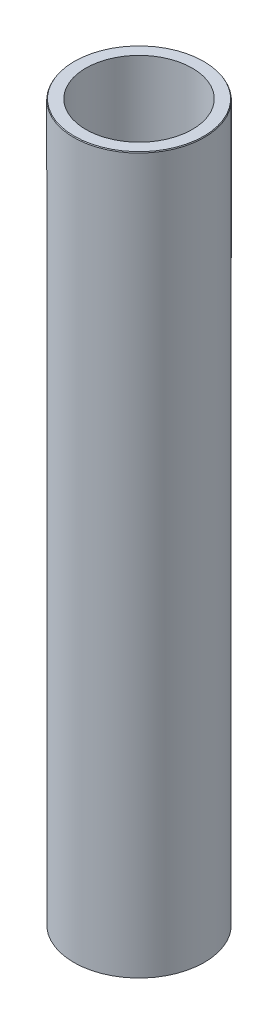
ISO-10303-21;
HEADER;
FILE_DESCRIPTION(('STEP AP214'),'2;1');
FILE_NAME('part.step','',(''),(''),'','','');
FILE_SCHEMA(('AUTOMOTIVE_DESIGN { 1 0 10303 214 1 1 1 1 }'));
ENDSEC;
DATA;
#1=APPLICATION_CONTEXT('core data for automotive mechanical design processes');
#2=APPLICATION_PROTOCOL_DEFINITION('international standard','automotive_design',2000,#1);
#3=PRODUCT_CONTEXT('',#1,'mechanical');
#4=PRODUCT('Part','Part','',(#3));
#5=PRODUCT_RELATED_PRODUCT_CATEGORY('part','',(#4));
#6=PRODUCT_DEFINITION_FORMATION('','',#4);
#7=PRODUCT_DEFINITION_CONTEXT('part definition',#1,'design');
#8=PRODUCT_DEFINITION('design','',#6,#7);
#9=PRODUCT_DEFINITION_SHAPE('','',#8);
#10=(LENGTH_UNIT() NAMED_UNIT(*) SI_UNIT(.MILLI.,.METRE.));
#11=(NAMED_UNIT(*) PLANE_ANGLE_UNIT() SI_UNIT($,.RADIAN.));
#12=(NAMED_UNIT(*) SI_UNIT($,.STERADIAN.) SOLID_ANGLE_UNIT());
#13=UNCERTAINTY_MEASURE_WITH_UNIT(LENGTH_MEASURE(1.E-05),#10,'distance_accuracy_value','');
#14=(GEOMETRIC_REPRESENTATION_CONTEXT(3) GLOBAL_UNCERTAINTY_ASSIGNED_CONTEXT((#13)) GLOBAL_UNIT_ASSIGNED_CONTEXT((#10,
#11,#12)) REPRESENTATION_CONTEXT('',''));
#15=CARTESIAN_POINT('',(0.,0.,0.));
#16=DIRECTION('',(0.,0.,1.));
#17=DIRECTION('',(1.,0.,0.));
#18=AXIS2_PLACEMENT_3D('',#15,#16,#17);
#19=CARTESIAN_POINT('',(0.,466.05665549588,0.));
#20=DIRECTION('',(0.,-1.,0.));
#21=DIRECTION('',(0.,0.,-1.));
#22=AXIS2_PLACEMENT_3D('',#19,#20,#21);
#23=CYLINDRICAL_SURFACE('',#22,42.5);
#24=CARTESIAN_POINT('',(0.,465.484988848938,0.));
#25=DIRECTION('',(0.,1.,0.));
#26=DIRECTION('',(0.,0.,1.));
#27=AXIS2_PLACEMENT_3D('',#24,#25,#26);
#28=CIRCLE('',#27,42.5);
#29=CARTESIAN_POINT('',(0.,465.484988848938,-42.5));
#30=VERTEX_POINT('',#29);
#31=EDGE_CURVE('E50',#30,#30,#28,.F.);
#32=CARTESIAN_POINT('',(0.,0.330051892498795,0.));
#33=DIRECTION('',(0.,1.,0.));
#34=DIRECTION('',(0.,0.,1.));
#35=AXIS2_PLACEMENT_3D('',#32,#33,#34);
#36=CIRCLE('',#35,42.5);
#37=CARTESIAN_POINT('',(0.,0.330051892498739,-42.5));
#38=VERTEX_POINT('',#37);
#39=EDGE_CURVE('E51',#38,#38,#36,.T.);
#40=CARTESIAN_POINT('',(0.,465.484988848938,-42.5));
#41=CARTESIAN_POINT('',(0.,460.639624922308,-42.5));
#42=CARTESIAN_POINT('',(0.,455.794260995678,-42.5));
#43=CARTESIAN_POINT('',(0.,446.103533142419,-42.5));
#44=CARTESIAN_POINT('',(0.,441.25816921579,-42.5));
#45=CARTESIAN_POINT('',(0.,431.567441362531,-42.5));
#46=CARTESIAN_POINT('',(0.,426.722077435901,-42.5));
#47=CARTESIAN_POINT('',(0.,417.031349582642,-42.5));
#48=CARTESIAN_POINT('',(0.,412.185985656012,-42.5));
#49=CARTESIAN_POINT('',(0.,402.495257802753,-42.5));
#50=CARTESIAN_POINT('',(0.,397.649893876124,-42.5));
#51=CARTESIAN_POINT('',(0.,387.959166022864,-42.5));
#52=CARTESIAN_POINT('',(0.,383.113802096235,-42.5));
#53=CARTESIAN_POINT('',(0.,373.423074242976,-42.5));
#54=CARTESIAN_POINT('',(0.,368.577710316346,-42.5));
#55=CARTESIAN_POINT('',(0.,358.886982463087,-42.5));
#56=CARTESIAN_POINT('',(0.,354.041618536458,-42.5));
#57=CARTESIAN_POINT('',(0.,344.350890683198,-42.5));
#58=CARTESIAN_POINT('',(0.,339.505526756569,-42.5));
#59=CARTESIAN_POINT('',(0.,329.81479890331,-42.5));
#60=CARTESIAN_POINT('',(0.,324.96943497668,-42.5));
#61=CARTESIAN_POINT('',(0.,315.278707123421,-42.5));
#62=CARTESIAN_POINT('',(0.,310.433343196791,-42.5));
#63=CARTESIAN_POINT('',(0.,300.742615343532,-42.5));
#64=CARTESIAN_POINT('',(0.,295.897251416903,-42.5));
#65=CARTESIAN_POINT('',(0.,286.206523563643,-42.5));
#66=CARTESIAN_POINT('',(0.,281.361159637014,-42.5));
#67=CARTESIAN_POINT('',(0.,271.670431783755,-42.5));
#68=CARTESIAN_POINT('',(0.,266.825067857125,-42.5));
#69=CARTESIAN_POINT('',(0.,257.134340003866,-42.5));
#70=CARTESIAN_POINT('',(0.,252.288976077236,-42.5));
#71=CARTESIAN_POINT('',(0.,242.598248223977,-42.5));
#72=CARTESIAN_POINT('',(0.,237.752884297348,-42.5));
#73=CARTESIAN_POINT('',(0.,228.062156444089,-42.5));
#74=CARTESIAN_POINT('',(0.,223.216792517459,-42.5));
#75=CARTESIAN_POINT('',(0.,213.5260646642,-42.5));
#76=CARTESIAN_POINT('',(0.,208.68070073757,-42.5));
#77=CARTESIAN_POINT('',(0.,198.989972884311,-42.5));
#78=CARTESIAN_POINT('',(0.,194.144608957682,-42.5));
#79=CARTESIAN_POINT('',(0.,184.453881104422,-42.5));
#80=CARTESIAN_POINT('',(0.,179.608517177793,-42.5));
#81=CARTESIAN_POINT('',(0.,169.917789324534,-42.5));
#82=CARTESIAN_POINT('',(0.,165.072425397904,-42.5));
#83=CARTESIAN_POINT('',(0.,155.381697544645,-42.5));
#84=CARTESIAN_POINT('',(0.,150.536333618015,-42.5));
#85=CARTESIAN_POINT('',(0.,140.845605764756,-42.5));
#86=CARTESIAN_POINT('',(0.,136.000241838127,-42.5));
#87=CARTESIAN_POINT('',(0.,126.309513984868,-42.5));
#88=CARTESIAN_POINT('',(0.,121.464150058238,-42.5));
#89=CARTESIAN_POINT('',(0.,111.773422204979,-42.5));
#90=CARTESIAN_POINT('',(0.,106.928058278349,-42.5));
#91=CARTESIAN_POINT('',(0.,97.2373304250902,-42.5));
#92=CARTESIAN_POINT('',(0.,92.3919664984606,-42.5));
#93=CARTESIAN_POINT('',(0.,82.7012386452015,-42.5));
#94=CARTESIAN_POINT('',(0.,77.8558747185719,-42.5));
#95=CARTESIAN_POINT('',(0.,68.1651468653127,-42.5));
#96=CARTESIAN_POINT('',(0.,63.3197829386832,-42.5));
#97=CARTESIAN_POINT('',(0.,53.629055085424,-42.5));
#98=CARTESIAN_POINT('',(0.,48.7836911587945,-42.5));
#99=CARTESIAN_POINT('',(0.,39.0929633055353,-42.5));
#100=CARTESIAN_POINT('',(0.,34.2475993789057,-42.5));
#101=CARTESIAN_POINT('',(0.,24.5568715256466,-42.5));
#102=CARTESIAN_POINT('',(0.,19.711507599017,-42.5));
#103=CARTESIAN_POINT('',(0.,10.0207797457579,-42.5));
#104=CARTESIAN_POINT('',(0.,5.17541581912832,-42.5));
#105=CARTESIAN_POINT('',(0.,0.330051892498739,-42.5));
#106=B_SPLINE_CURVE_WITH_KNOTS('',3,(#40,#41,#42,#43,#44,#45,#46,#47,#48,#49,#50,#51,#52,#53,
#54,#55,#56,#57,#58,#59,#60,#61,#62,#63,#64,#65,#66,#67,#68,#69,#70,#71,#72,#73,#74,#75,#76,#77,
#78,#79,#80,#81,#82,#83,#84,#85,#86,#87,#88,#89,#90,#91,#92,#93,#94,#95,#96,#97,#98,#99,#100,
#101,#102,#103,#104,#105),.UNSPECIFIED.,.F.,.F.,(4,2,2,2,2,2,2,2,2,2,2,2,2,2,2,2,2,2,2,2,2,2,2,
2,2,2,2,2,2,2,2,2,4),(0.,14.5360917798887,29.0721835597774,43.6082753396661,58.1443671195548,
72.6804588994435,87.2165506793323,101.752642459221,116.28873423911,130.824826018998,
145.360917798887,159.897009578776,174.433101358665,188.969193138553,203.505284918442,
218.041376698331,232.577468478219,247.113560258108,261.649652037997,276.185743817886,
290.721835597774,305.257927377663,319.794019157552,334.33011093744,348.866202717329,
363.402294497218,377.938386277107,392.474478056995,407.010569836884,421.546661616773,
436.082753396661,450.61884517655,465.154936956439),.UNSPECIFIED.);
#107=EDGE_CURVE('BSEAM39',#30,#38,#106,.T.);
#108=ORIENTED_EDGE('',*,*,#31,.T.);
#109=ORIENTED_EDGE('',*,*,#39,.T.);
#110=ORIENTED_EDGE('',*,*,#107,.T.);
#111=ORIENTED_EDGE('',*,*,#107,.F.);
#112=EDGE_LOOP('',(#108,#110,#109,#111));
#113=FACE_BOUND('',#112,.T.);
#114=ADVANCED_FACE('F39',(#113),#23,.T.);
#115=CARTESIAN_POINT('',(0.,466.05665549588,0.));
#116=DIRECTION('',(0.,1.,0.));
#117=DIRECTION('',(0.,0.,1.));
#118=AXIS2_PLACEMENT_3D('',#115,#116,#117);
#119=PLANE('',#118);
#120=CARTESIAN_POINT('',(0.,466.05665549588,0.));
#121=DIRECTION('',(0.,1.,0.));
#122=DIRECTION('',(0.,0.,1.));
#123=AXIS2_PLACEMENT_3D('',#120,#121,#122);
#124=CIRCLE('',#123,42.1699481075014);
#125=CARTESIAN_POINT('',(0.,466.05665549588,42.1699481075014));
#126=VERTEX_POINT('',#125);
#127=EDGE_CURVE('E54',#126,#126,#124,.T.);
#128=ORIENTED_EDGE('',*,*,#127,.T.);
#129=EDGE_LOOP('',(#128));
#130=FACE_BOUND('',#129,.T.);
#131=CARTESIAN_POINT('',(0.,466.05665549588,0.));
#132=DIRECTION('',(0.,1.,0.));
#133=DIRECTION('',(0.,0.,1.));
#134=AXIS2_PLACEMENT_3D('',#131,#132,#133);
#135=CIRCLE('',#134,34.6484414434877);
#136=CARTESIAN_POINT('',(0.,466.05665549588,-34.6484414434877));
#137=VERTEX_POINT('',#136);
#138=EDGE_CURVE('E58',#137,#137,#135,.T.);
#139=ORIENTED_EDGE('',*,*,#138,.F.);
#140=EDGE_LOOP('',(#139));
#141=FACE_BOUND('',#140,.T.);
#142=ADVANCED_FACE('F69',(#130,#141),#119,.T.);
#143=CARTESIAN_POINT('',(0.,0.,0.));
#144=DIRECTION('',(0.,1.,0.));
#145=DIRECTION('',(0.,0.,1.));
#146=AXIS2_PLACEMENT_3D('',#143,#144,#145);
#147=PLANE('',#146);
#148=CARTESIAN_POINT('',(0.,0.,0.));
#149=DIRECTION('',(0.,1.,0.));
#150=DIRECTION('',(0.,0.,1.));
#151=AXIS2_PLACEMENT_3D('',#148,#149,#150);
#152=CIRCLE('',#151,41.9283333530578);
#153=CARTESIAN_POINT('',(0.,0.,41.9283333530578));
#154=VERTEX_POINT('',#153);
#155=EDGE_CURVE('E10',#154,#154,#152,.F.);
#156=ORIENTED_EDGE('',*,*,#155,.T.);
#157=EDGE_LOOP('',(#156));
#158=FACE_BOUND('',#157,.T.);
#159=CARTESIAN_POINT('',(0.,0.,0.));
#160=DIRECTION('',(0.,1.,0.));
#161=DIRECTION('',(0.,0.,1.));
#162=AXIS2_PLACEMENT_3D('',#159,#160,#161);
#163=CIRCLE('',#162,34.6484414434877);
#164=CARTESIAN_POINT('',(0.,0.,-34.6484414434877));
#165=VERTEX_POINT('',#164);
#166=EDGE_CURVE('E63',#165,#165,#163,.T.);
#167=ORIENTED_EDGE('',*,*,#166,.T.);
#168=EDGE_LOOP('',(#167));
#169=FACE_BOUND('',#168,.T.);
#170=ADVANCED_FACE('F75',(#158,#169),#147,.F.);
#171=CARTESIAN_POINT('',(0.,466.05665549588,0.));
#172=DIRECTION('',(0.,-1.,0.));
#173=DIRECTION('',(0.,0.,-1.));
#174=AXIS2_PLACEMENT_3D('',#171,#172,#173);
#175=CYLINDRICAL_SURFACE('',#174,34.6484414434877);
#176=CARTESIAN_POINT('',(0.,466.05665549588,-34.6484414434877));
#177=CARTESIAN_POINT('',(0.,461.201898667797,-34.6484414434877));
#178=CARTESIAN_POINT('',(0.,456.347141839715,-34.6484414434877));
#179=CARTESIAN_POINT('',(0.,446.637628183551,-34.6484414434877));
#180=CARTESIAN_POINT('',(0.,441.782871355469,-34.6484414434877));
#181=CARTESIAN_POINT('',(0.,432.073357699305,-34.6484414434877));
#182=CARTESIAN_POINT('',(0.,427.218600871223,-34.6484414434877));
#183=CARTESIAN_POINT('',(0.,417.509087215059,-34.6484414434877));
#184=CARTESIAN_POINT('',(0.,412.654330386977,-34.6484414434877));
#185=CARTESIAN_POINT('',(0.,402.944816730812,-34.6484414434877));
#186=CARTESIAN_POINT('',(0.,398.09005990273,-34.6484414434877));
#187=CARTESIAN_POINT('',(0.,388.380546246566,-34.6484414434877));
#188=CARTESIAN_POINT('',(0.,383.525789418484,-34.6484414434877));
#189=CARTESIAN_POINT('',(0.,373.81627576232,-34.6484414434877));
#190=CARTESIAN_POINT('',(0.,368.961518934238,-34.6484414434877));
#191=CARTESIAN_POINT('',(0.,359.252005278074,-34.6484414434877));
#192=CARTESIAN_POINT('',(0.,354.397248449992,-34.6484414434877));
#193=CARTESIAN_POINT('',(0.,344.687734793828,-34.6484414434877));
#194=CARTESIAN_POINT('',(0.,339.832977965745,-34.6484414434877));
#195=CARTESIAN_POINT('',(0.,330.123464309581,-34.6484414434877));
#196=CARTESIAN_POINT('',(0.,325.268707481499,-34.6484414434877));
#197=CARTESIAN_POINT('',(0.,315.559193825335,-34.6484414434877));
#198=CARTESIAN_POINT('',(0.,310.704436997253,-34.6484414434877));
#199=CARTESIAN_POINT('',(0.,300.994923341089,-34.6484414434877));
#200=CARTESIAN_POINT('',(0.,296.140166513007,-34.6484414434877));
#201=CARTESIAN_POINT('',(0.,286.430652856843,-34.6484414434877));
#202=CARTESIAN_POINT('',(0.,281.57589602876,-34.6484414434877));
#203=CARTESIAN_POINT('',(0.,271.866382372596,-34.6484414434877));
#204=CARTESIAN_POINT('',(0.,267.011625544514,-34.6484414434877));
#205=CARTESIAN_POINT('',(0.,257.30211188835,-34.6484414434877));
#206=CARTESIAN_POINT('',(0.,252.447355060268,-34.6484414434877));
#207=CARTESIAN_POINT('',(0.,242.737841404104,-34.6484414434877));
#208=CARTESIAN_POINT('',(0.,237.883084576022,-34.6484414434877));
#209=CARTESIAN_POINT('',(0.,228.173570919858,-34.6484414434877));
#210=CARTESIAN_POINT('',(0.,223.318814091776,-34.6484414434877));
#211=CARTESIAN_POINT('',(0.,213.609300435611,-34.6484414434877));
#212=CARTESIAN_POINT('',(0.,208.754543607529,-34.6484414434877));
#213=CARTESIAN_POINT('',(0.,199.045029951365,-34.6484414434877));
#214=CARTESIAN_POINT('',(0.,194.190273123283,-34.6484414434877));
#215=CARTESIAN_POINT('',(0.,184.480759467119,-34.6484414434877));
#216=CARTESIAN_POINT('',(0.,179.626002639037,-34.6484414434877));
#217=CARTESIAN_POINT('',(0.,169.916488982873,-34.6484414434877));
#218=CARTESIAN_POINT('',(0.,165.061732154791,-34.6484414434877));
#219=CARTESIAN_POINT('',(0.,155.352218498626,-34.6484414434877));
#220=CARTESIAN_POINT('',(0.,150.497461670544,-34.6484414434877));
#221=CARTESIAN_POINT('',(0.,140.78794801438,-34.6484414434877));
#222=CARTESIAN_POINT('',(0.,135.933191186298,-34.6484414434877));
#223=CARTESIAN_POINT('',(0.,126.223677530134,-34.6484414434877));
#224=CARTESIAN_POINT('',(0.,121.368920702052,-34.6484414434877));
#225=CARTESIAN_POINT('',(0.,111.659407045888,-34.6484414434877));
#226=CARTESIAN_POINT('',(0.,106.804650217806,-34.6484414434877));
#227=CARTESIAN_POINT('',(0.,97.0951365616415,-34.6484414434877));
#228=CARTESIAN_POINT('',(0.,92.2403797335594,-34.6484414434877));
#229=CARTESIAN_POINT('',(0.,82.5308660773953,-34.6484414434877));
#230=CARTESIAN_POINT('',(0.,77.6761092493132,-34.6484414434877));
#231=CARTESIAN_POINT('',(0.,67.9665955931491,-34.6484414434877));
#232=CARTESIAN_POINT('',(0.,63.111838765067,-34.6484414434877));
#233=CARTESIAN_POINT('',(0.,53.4023251089028,-34.6484414434877));
#234=CARTESIAN_POINT('',(0.,48.5475682808208,-34.6484414434877));
#235=CARTESIAN_POINT('',(0.,38.8380546246566,-34.6484414434877));
#236=CARTESIAN_POINT('',(0.,33.9832977965745,-34.6484414434877));
#237=CARTESIAN_POINT('',(0.,24.2737841404104,-34.6484414434877));
#238=CARTESIAN_POINT('',(0.,19.4190273123283,-34.6484414434877));
#239=CARTESIAN_POINT('',(0.,9.70951365616411,-34.6484414434877));
#240=CARTESIAN_POINT('',(0.,4.85475682808202,-34.6484414434877));
#241=CARTESIAN_POINT('',(0.,0.,-34.6484414434877));
#242=B_SPLINE_CURVE_WITH_KNOTS('',3,(#176,#177,#178,#179,#180,#181,#182,#183,#184,#185,#186,
#187,#188,#189,#190,#191,#192,#193,#194,#195,#196,#197,#198,#199,#200,#201,#202,#203,#204,#205,
#206,#207,#208,#209,#210,#211,#212,#213,#214,#215,#216,#217,#218,#219,#220,#221,#222,#223,#224,
#225,#226,#227,#228,#229,#230,#231,#232,#233,#234,#235,#236,#237,#238,#239,#240,#241),
.UNSPECIFIED.,.F.,.F.,(4,2,2,2,2,2,2,2,2,2,2,2,2,2,2,2,2,2,2,2,2,2,2,2,2,2,2,2,2,2,2,2,4),(0.,
14.5642704842462,29.1285409684925,43.6928114527387,58.257081936985,72.8213524212312,
87.3856229054775,101.949893389724,116.51416387397,131.078434358216,145.642704842462,
160.206975326709,174.771245810955,189.335516295201,203.899786779447,218.464057263694,
233.02832774794,247.592598232186,262.156868716432,276.721139200678,291.285409684925,
305.849680169171,320.413950653417,334.978221137663,349.54249162191,364.106762106156,
378.671032590402,393.235303074648,407.799573558895,422.363844043141,436.928114527387,
451.492385011633,466.05665549588),.UNSPECIFIED.);
#243=EDGE_CURVE('BSEAM70',#137,#165,#242,.T.);
#244=ORIENTED_EDGE('',*,*,#138,.T.);
#245=ORIENTED_EDGE('',*,*,#166,.F.);
#246=ORIENTED_EDGE('',*,*,#243,.T.);
#247=ORIENTED_EDGE('',*,*,#243,.F.);
#248=EDGE_LOOP('',(#244,#246,#245,#247));
#249=FACE_BOUND('',#248,.T.);
#250=ADVANCED_FACE('F70',(#249),#175,.F.);
#251=CARTESIAN_POINT('',(0.,466.05665549588,0.));
#252=DIRECTION('',(0.,-1.,0.));
#253=DIRECTION('',(0.,0.,-1.));
#254=AXIS2_PLACEMENT_3D('',#251,#252,#253);
#255=CONICAL_SURFACE('',#254,42.1699481075014,0.523598775598355);
#256=ORIENTED_EDGE('',*,*,#31,.F.);
#257=EDGE_LOOP('',(#256));
#258=FACE_BOUND('',#257,.T.);
#259=ORIENTED_EDGE('',*,*,#127,.F.);
#260=EDGE_LOOP('',(#259));
#261=FACE_BOUND('',#260,.T.);
#262=ADVANCED_FACE('F81',(#258,#261),#255,.T.);
#263=CARTESIAN_POINT('',(0.,0.330051892498795,0.));
#264=DIRECTION('',(0.,1.,0.));
#265=DIRECTION('',(0.,0.,1.));
#266=AXIS2_PLACEMENT_3D('',#263,#264,#265);
#267=CONICAL_SURFACE('',#266,42.5,1.0471975511966);
#268=ORIENTED_EDGE('',*,*,#155,.F.);
#269=EDGE_LOOP('',(#268));
#270=FACE_BOUND('',#269,.T.);
#271=ORIENTED_EDGE('',*,*,#39,.F.);
#272=EDGE_LOOP('',(#271));
#273=FACE_BOUND('',#272,.T.);
#274=ADVANCED_FACE('F45',(#270,#273),#267,.T.);
#275=CLOSED_SHELL('',(#114,#142,#170,#250,#262,#274));
#276=MANIFOLD_SOLID_BREP('B2',#275);
#277=ADVANCED_BREP_SHAPE_REPRESENTATION('',(#18,#276),#14);
#278=SHAPE_DEFINITION_REPRESENTATION(#9,#277);
ENDSEC;
END-ISO-10303-21;
